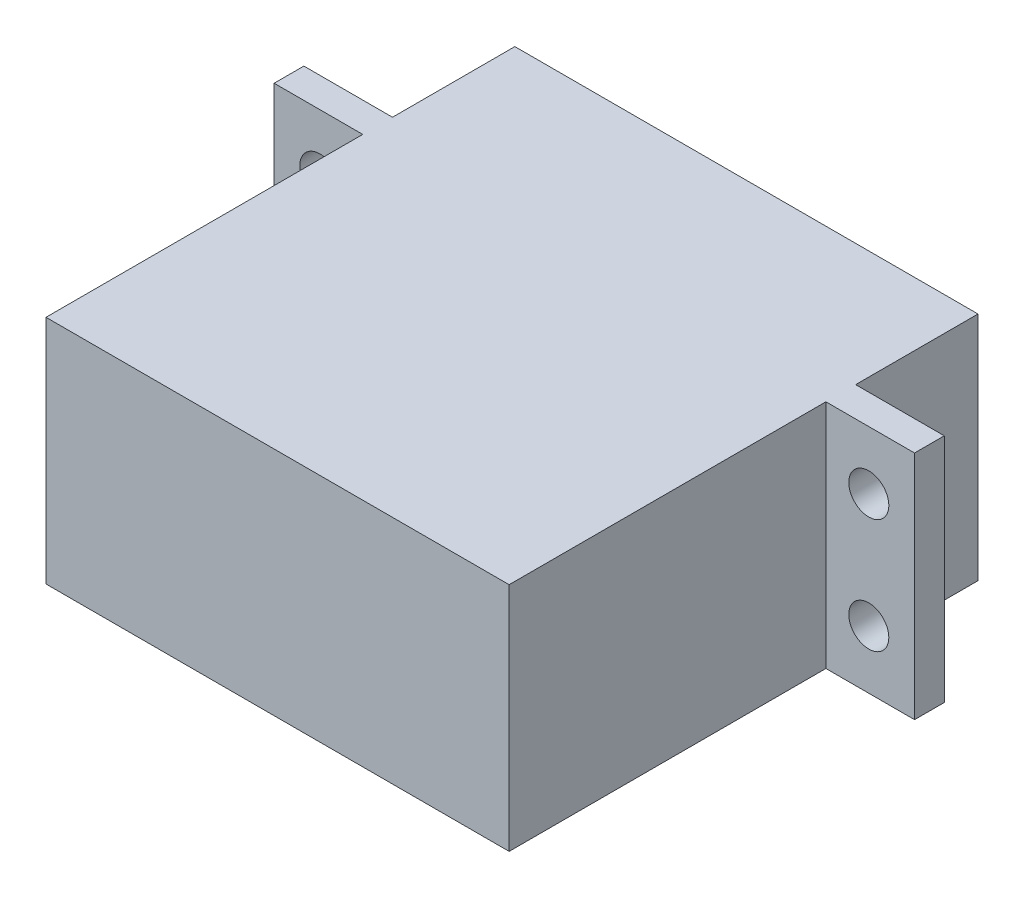
ISO-10303-21;
HEADER;
FILE_DESCRIPTION(('STEP AP214'),'2;1');
FILE_NAME('part.step','',(''),(''),'','','');
FILE_SCHEMA(('AUTOMOTIVE_DESIGN { 1 0 10303 214 1 1 1 1 }'));
ENDSEC;
DATA;
#1=APPLICATION_CONTEXT('core data for automotive mechanical design processes');
#2=APPLICATION_PROTOCOL_DEFINITION('international standard','automotive_design',2000,#1);
#3=PRODUCT_CONTEXT('',#1,'mechanical');
#4=PRODUCT('Part','Part','',(#3));
#5=PRODUCT_RELATED_PRODUCT_CATEGORY('part','',(#4));
#6=PRODUCT_DEFINITION_FORMATION('','',#4);
#7=PRODUCT_DEFINITION_CONTEXT('part definition',#1,'design');
#8=PRODUCT_DEFINITION('design','',#6,#7);
#9=PRODUCT_DEFINITION_SHAPE('','',#8);
#10=(LENGTH_UNIT() NAMED_UNIT(*) SI_UNIT(.MILLI.,.METRE.));
#11=(NAMED_UNIT(*) PLANE_ANGLE_UNIT() SI_UNIT($,.RADIAN.));
#12=(NAMED_UNIT(*) SI_UNIT($,.STERADIAN.) SOLID_ANGLE_UNIT());
#13=UNCERTAINTY_MEASURE_WITH_UNIT(LENGTH_MEASURE(1.E-05),#10,'distance_accuracy_value','');
#14=(GEOMETRIC_REPRESENTATION_CONTEXT(3) GLOBAL_UNCERTAINTY_ASSIGNED_CONTEXT((#13)) GLOBAL_UNIT_ASSIGNED_CONTEXT((#10,
#11,#12)) REPRESENTATION_CONTEXT('',''));
#15=CARTESIAN_POINT('',(0.,0.,0.));
#16=DIRECTION('',(0.,0.,1.));
#17=DIRECTION('',(1.,0.,0.));
#18=AXIS2_PLACEMENT_3D('',#15,#16,#17);
#19=CARTESIAN_POINT('',(20.25,-10.1,41.));
#20=DIRECTION('',(-1.,0.,0.));
#21=DIRECTION('',(0.,0.,1.));
#22=AXIS2_PLACEMENT_3D('',#19,#20,#21);
#23=PLANE('',#22);
#24=DIRECTION('',(0.,-1.,0.));
#25=VECTOR('',#24,1.);
#26=CARTESIAN_POINT('',(20.25,-10.1,13.3));
#27=LINE('',#26,#25);
#28=CARTESIAN_POINT('',(20.25,10.1,13.3));
#29=VERTEX_POINT('',#28);
#30=CARTESIAN_POINT('',(20.25,-10.1,13.3));
#31=VERTEX_POINT('',#30);
#32=EDGE_CURVE('E58',#29,#31,#27,.T.);
#33=ORIENTED_EDGE('',*,*,#32,.F.);
#34=DIRECTION('',(0.,0.,-1.));
#35=VECTOR('',#34,1.);
#36=CARTESIAN_POINT('',(20.25,10.1,41.));
#37=LINE('',#36,#35);
#38=CARTESIAN_POINT('',(20.25,10.1,41.));
#39=VERTEX_POINT('',#38);
#40=EDGE_CURVE('E11',#39,#29,#37,.T.);
#41=ORIENTED_EDGE('',*,*,#40,.F.);
#42=DIRECTION('',(0.,1.,0.));
#43=VECTOR('',#42,1.);
#44=CARTESIAN_POINT('',(20.25,-10.1,41.));
#45=LINE('',#44,#43);
#46=CARTESIAN_POINT('',(20.25,-10.1,41.));
#47=VERTEX_POINT('',#46);
#48=EDGE_CURVE('E217',#47,#39,#45,.T.);
#49=ORIENTED_EDGE('',*,*,#48,.F.);
#50=DIRECTION('',(0.,0.,-1.));
#51=VECTOR('',#50,1.);
#52=CARTESIAN_POINT('',(20.25,-10.1,41.));
#53=LINE('',#52,#51);
#54=EDGE_CURVE('E237',#47,#31,#53,.T.);
#55=ORIENTED_EDGE('',*,*,#54,.T.);
#56=EDGE_LOOP('',(#33,#41,#49,#55));
#57=FACE_BOUND('',#56,.T.);
#58=ADVANCED_FACE('F36',(#57),#23,.F.);
#59=CARTESIAN_POINT('',(-20.25,-10.1,41.));
#60=DIRECTION('',(1.,0.,0.));
#61=DIRECTION('',(0.,0.,-1.));
#62=AXIS2_PLACEMENT_3D('',#59,#60,#61);
#63=PLANE('',#62);
#64=DIRECTION('',(0.,1.,0.));
#65=VECTOR('',#64,1.);
#66=CARTESIAN_POINT('',(-20.25,-10.1,13.3));
#67=LINE('',#66,#65);
#68=CARTESIAN_POINT('',(-20.25,-10.1,13.3));
#69=VERTEX_POINT('',#68);
#70=CARTESIAN_POINT('',(-20.25,10.1,13.3));
#71=VERTEX_POINT('',#70);
#72=EDGE_CURVE('E202',#69,#71,#67,.T.);
#73=ORIENTED_EDGE('',*,*,#72,.F.);
#74=DIRECTION('',(0.,0.,-1.));
#75=VECTOR('',#74,1.);
#76=CARTESIAN_POINT('',(-20.25,-10.1,41.));
#77=LINE('',#76,#75);
#78=CARTESIAN_POINT('',(-20.25,-10.1,41.));
#79=VERTEX_POINT('',#78);
#80=EDGE_CURVE('E240',#79,#69,#77,.T.);
#81=ORIENTED_EDGE('',*,*,#80,.F.);
#82=DIRECTION('',(0.,-1.,0.));
#83=VECTOR('',#82,1.);
#84=CARTESIAN_POINT('',(-20.25,-10.1,41.));
#85=LINE('',#84,#83);
#86=CARTESIAN_POINT('',(-20.25,10.1,41.));
#87=VERTEX_POINT('',#86);
#88=EDGE_CURVE('E223',#87,#79,#85,.T.);
#89=ORIENTED_EDGE('',*,*,#88,.F.);
#90=DIRECTION('',(0.,0.,-1.));
#91=VECTOR('',#90,1.);
#92=CARTESIAN_POINT('',(-20.25,10.1,41.));
#93=LINE('',#92,#91);
#94=EDGE_CURVE('E243',#87,#71,#93,.T.);
#95=ORIENTED_EDGE('',*,*,#94,.T.);
#96=EDGE_LOOP('',(#73,#81,#89,#95));
#97=FACE_BOUND('',#96,.T.);
#98=ADVANCED_FACE('F279',(#97),#63,.F.);
#99=CARTESIAN_POINT('',(20.25,10.1,10.7));
#100=VERTEX_POINT('',#99);
#101=CARTESIAN_POINT('',(20.25,10.1,0.));
#102=VERTEX_POINT('',#101);
#103=EDGE_CURVE('E44',#100,#102,#37,.T.);
#104=ORIENTED_EDGE('',*,*,#103,.F.);
#105=DIRECTION('',(0.,-1.,0.));
#106=VECTOR('',#105,1.);
#107=CARTESIAN_POINT('',(20.25,-10.1,10.7));
#108=LINE('',#107,#106);
#109=CARTESIAN_POINT('',(20.25,-10.1,10.7));
#110=VERTEX_POINT('',#109);
#111=EDGE_CURVE('E214',#100,#110,#108,.T.);
#112=ORIENTED_EDGE('',*,*,#111,.T.);
#113=CARTESIAN_POINT('',(20.25,-10.1,0.));
#114=VERTEX_POINT('',#113);
#115=EDGE_CURVE('E227',#110,#114,#53,.T.);
#116=ORIENTED_EDGE('',*,*,#115,.T.);
#117=DIRECTION('',(0.,1.,0.));
#118=VECTOR('',#117,1.);
#119=CARTESIAN_POINT('',(20.25,-10.1,0.));
#120=LINE('',#119,#118);
#121=EDGE_CURVE('E216',#114,#102,#120,.T.);
#122=ORIENTED_EDGE('',*,*,#121,.T.);
#123=EDGE_LOOP('',(#104,#112,#116,#122));
#124=FACE_BOUND('',#123,.T.);
#125=ADVANCED_FACE('F38',(#124),#23,.F.);
#126=CARTESIAN_POINT('',(-20.25,10.1,41.));
#127=DIRECTION('',(0.,-1.,0.));
#128=DIRECTION('',(0.,0.,-1.));
#129=AXIS2_PLACEMENT_3D('',#126,#127,#128);
#130=PLANE('',#129);
#131=CARTESIAN_POINT('',(-20.25,10.1,10.7));
#132=VERTEX_POINT('',#131);
#133=CARTESIAN_POINT('',(-20.25,10.1,0.));
#134=VERTEX_POINT('',#133);
#135=EDGE_CURVE('E242',#132,#134,#93,.T.);
#136=ORIENTED_EDGE('',*,*,#135,.F.);
#137=DIRECTION('',(-1.,0.,0.));
#138=VECTOR('',#137,1.);
#139=CARTESIAN_POINT('',(-28.,10.1,10.7));
#140=LINE('',#139,#138);
#141=CARTESIAN_POINT('',(-28.,10.1,10.7));
#142=VERTEX_POINT('',#141);
#143=EDGE_CURVE('E174',#132,#142,#140,.T.);
#144=ORIENTED_EDGE('',*,*,#143,.T.);
#145=DIRECTION('',(0.,0.,1.));
#146=VECTOR('',#145,1.);
#147=CARTESIAN_POINT('',(-28.,10.1,10.7));
#148=LINE('',#147,#146);
#149=CARTESIAN_POINT('',(-28.,10.1,13.3));
#150=VERTEX_POINT('',#149);
#151=EDGE_CURVE('E205',#142,#150,#148,.T.);
#152=ORIENTED_EDGE('',*,*,#151,.T.);
#153=DIRECTION('',(-1.,0.,0.));
#154=VECTOR('',#153,1.);
#155=CARTESIAN_POINT('',(-28.,10.1,13.3));
#156=LINE('',#155,#154);
#157=EDGE_CURVE('E189',#71,#150,#156,.T.);
#158=ORIENTED_EDGE('',*,*,#157,.F.);
#159=ORIENTED_EDGE('',*,*,#94,.F.);
#160=DIRECTION('',(-1.,0.,0.));
#161=VECTOR('',#160,1.);
#162=CARTESIAN_POINT('',(-20.25,10.1,41.));
#163=LINE('',#162,#161);
#164=EDGE_CURVE('E220',#39,#87,#163,.T.);
#165=ORIENTED_EDGE('',*,*,#164,.F.);
#166=ORIENTED_EDGE('',*,*,#40,.T.);
#167=CARTESIAN_POINT('',(28.,10.1,13.3));
#168=VERTEX_POINT('',#167);
#169=EDGE_CURVE('E190',#168,#29,#156,.T.);
#170=ORIENTED_EDGE('',*,*,#169,.F.);
#171=DIRECTION('',(0.,0.,1.));
#172=VECTOR('',#171,1.);
#173=CARTESIAN_POINT('',(28.,10.1,10.7));
#174=LINE('',#173,#172);
#175=CARTESIAN_POINT('',(28.,10.1,10.7));
#176=VERTEX_POINT('',#175);
#177=EDGE_CURVE('E186',#176,#168,#174,.T.);
#178=ORIENTED_EDGE('',*,*,#177,.F.);
#179=EDGE_CURVE('E176',#176,#100,#140,.T.);
#180=ORIENTED_EDGE('',*,*,#179,.T.);
#181=ORIENTED_EDGE('',*,*,#103,.T.);
#182=DIRECTION('',(-1.,0.,0.));
#183=VECTOR('',#182,1.);
#184=CARTESIAN_POINT('',(-20.25,10.1,0.));
#185=LINE('',#184,#183);
#186=EDGE_CURVE('E229',#102,#134,#185,.T.);
#187=ORIENTED_EDGE('',*,*,#186,.T.);
#188=EDGE_LOOP('',(#136,#144,#152,#158,#159,#165,#166,#170,#178,#180,#181,#187));
#189=FACE_BOUND('',#188,.T.);
#190=ADVANCED_FACE('F256',(#189),#130,.F.);
#191=CARTESIAN_POINT('',(-20.25,-10.1,10.7));
#192=VERTEX_POINT('',#191);
#193=CARTESIAN_POINT('',(-20.25,-10.1,0.));
#194=VERTEX_POINT('',#193);
#195=EDGE_CURVE('E239',#192,#194,#77,.T.);
#196=ORIENTED_EDGE('',*,*,#195,.F.);
#197=DIRECTION('',(0.,1.,0.));
#198=VECTOR('',#197,1.);
#199=CARTESIAN_POINT('',(-20.25,-10.1,10.7));
#200=LINE('',#199,#198);
#201=EDGE_CURVE('E212',#192,#132,#200,.T.);
#202=ORIENTED_EDGE('',*,*,#201,.T.);
#203=ORIENTED_EDGE('',*,*,#135,.T.);
#204=DIRECTION('',(0.,-1.,0.));
#205=VECTOR('',#204,1.);
#206=CARTESIAN_POINT('',(-20.25,-10.1,0.));
#207=LINE('',#206,#205);
#208=EDGE_CURVE('E232',#134,#194,#207,.T.);
#209=ORIENTED_EDGE('',*,*,#208,.T.);
#210=EDGE_LOOP('',(#196,#202,#203,#209));
#211=FACE_BOUND('',#210,.T.);
#212=ADVANCED_FACE('F249',(#211),#63,.F.);
#213=CARTESIAN_POINT('',(-20.25,-10.1,41.));
#214=DIRECTION('',(0.,1.,0.));
#215=DIRECTION('',(0.,0.,1.));
#216=AXIS2_PLACEMENT_3D('',#213,#214,#215);
#217=PLANE('',#216);
#218=ORIENTED_EDGE('',*,*,#115,.F.);
#219=DIRECTION('',(1.,0.,0.));
#220=VECTOR('',#219,1.);
#221=CARTESIAN_POINT('',(-28.,-10.1,10.7));
#222=LINE('',#221,#220);
#223=CARTESIAN_POINT('',(28.,-10.1,10.7));
#224=VERTEX_POINT('',#223);
#225=EDGE_CURVE('E182',#110,#224,#222,.T.);
#226=ORIENTED_EDGE('',*,*,#225,.T.);
#227=DIRECTION('',(0.,0.,1.));
#228=VECTOR('',#227,1.);
#229=CARTESIAN_POINT('',(28.,-10.1,10.7));
#230=LINE('',#229,#228);
#231=CARTESIAN_POINT('',(28.,-10.1,13.3));
#232=VERTEX_POINT('',#231);
#233=EDGE_CURVE('E199',#224,#232,#230,.T.);
#234=ORIENTED_EDGE('',*,*,#233,.T.);
#235=DIRECTION('',(1.,0.,0.));
#236=VECTOR('',#235,1.);
#237=CARTESIAN_POINT('',(-28.,-10.1,13.3));
#238=LINE('',#237,#236);
#239=EDGE_CURVE('E196',#31,#232,#238,.T.);
#240=ORIENTED_EDGE('',*,*,#239,.F.);
#241=ORIENTED_EDGE('',*,*,#54,.F.);
#242=DIRECTION('',(1.,0.,0.));
#243=VECTOR('',#242,1.);
#244=CARTESIAN_POINT('',(-20.25,-10.1,41.));
#245=LINE('',#244,#243);
#246=EDGE_CURVE('E225',#79,#47,#245,.T.);
#247=ORIENTED_EDGE('',*,*,#246,.F.);
#248=ORIENTED_EDGE('',*,*,#80,.T.);
#249=CARTESIAN_POINT('',(-28.,-10.1,13.3));
#250=VERTEX_POINT('',#249);
#251=EDGE_CURVE('E175',#250,#69,#238,.T.);
#252=ORIENTED_EDGE('',*,*,#251,.F.);
#253=DIRECTION('',(0.,0.,1.));
#254=VECTOR('',#253,1.);
#255=CARTESIAN_POINT('',(-28.,-10.1,10.7));
#256=LINE('',#255,#254);
#257=CARTESIAN_POINT('',(-28.,-10.1,10.7));
#258=VERTEX_POINT('',#257);
#259=EDGE_CURVE('E203',#258,#250,#256,.T.);
#260=ORIENTED_EDGE('',*,*,#259,.F.);
#261=EDGE_CURVE('E183',#258,#192,#222,.T.);
#262=ORIENTED_EDGE('',*,*,#261,.T.);
#263=ORIENTED_EDGE('',*,*,#195,.T.);
#264=DIRECTION('',(1.,0.,0.));
#265=VECTOR('',#264,1.);
#266=CARTESIAN_POINT('',(-20.25,-10.1,0.));
#267=LINE('',#266,#265);
#268=EDGE_CURVE('E221',#194,#114,#267,.T.);
#269=ORIENTED_EDGE('',*,*,#268,.T.);
#270=EDGE_LOOP('',(#218,#226,#234,#240,#241,#247,#248,#252,#260,#262,#263,#269));
#271=FACE_BOUND('',#270,.T.);
#272=ADVANCED_FACE('F262',(#271),#217,.F.);
#273=CARTESIAN_POINT('',(0.,0.,41.));
#274=DIRECTION('',(0.,0.,-1.));
#275=DIRECTION('',(-1.,0.,0.));
#276=AXIS2_PLACEMENT_3D('',#273,#274,#275);
#277=PLANE('',#276);
#278=ORIENTED_EDGE('',*,*,#48,.T.);
#279=ORIENTED_EDGE('',*,*,#164,.T.);
#280=ORIENTED_EDGE('',*,*,#88,.T.);
#281=ORIENTED_EDGE('',*,*,#246,.T.);
#282=EDGE_LOOP('',(#278,#279,#280,#281));
#283=FACE_BOUND('',#282,.T.);
#284=ADVANCED_FACE('F283',(#283),#277,.F.);
#285=CARTESIAN_POINT('',(0.,0.,0.));
#286=DIRECTION('',(0.,0.,-1.));
#287=DIRECTION('',(-1.,0.,0.));
#288=AXIS2_PLACEMENT_3D('',#285,#286,#287);
#289=PLANE('',#288);
#290=CARTESIAN_POINT('',(-9.75,0.,0.));
#291=DIRECTION('',(0.,0.,-1.));
#292=DIRECTION('',(-1.,0.,0.));
#293=AXIS2_PLACEMENT_3D('',#290,#291,#292);
#294=CIRCLE('',#293,2.);
#295=CARTESIAN_POINT('',(-11.75,0.,0.));
#296=VERTEX_POINT('',#295);
#297=EDGE_CURVE('E135',#296,#296,#294,.T.);
#298=ORIENTED_EDGE('',*,*,#297,.F.);
#299=EDGE_LOOP('',(#298));
#300=FACE_BOUND('',#299,.T.);
#301=ORIENTED_EDGE('',*,*,#121,.F.);
#302=ORIENTED_EDGE('',*,*,#268,.F.);
#303=ORIENTED_EDGE('',*,*,#208,.F.);
#304=ORIENTED_EDGE('',*,*,#186,.F.);
#305=EDGE_LOOP('',(#301,#302,#303,#304));
#306=FACE_BOUND('',#305,.T.);
#307=ADVANCED_FACE('F259',(#300,#306),#289,.T.);
#308=CARTESIAN_POINT('',(-28.,-10.1,10.7));
#309=DIRECTION('',(-1.,0.,0.));
#310=DIRECTION('',(0.,-1.,0.));
#311=AXIS2_PLACEMENT_3D('',#308,#309,#310);
#312=PLANE('',#311);
#313=DIRECTION('',(0.,-1.,0.));
#314=VECTOR('',#313,1.);
#315=CARTESIAN_POINT('',(-28.,-10.1,13.3));
#316=LINE('',#315,#314);
#317=EDGE_CURVE('E193',#150,#250,#316,.T.);
#318=ORIENTED_EDGE('',*,*,#317,.F.);
#319=ORIENTED_EDGE('',*,*,#151,.F.);
#320=DIRECTION('',(0.,-1.,0.));
#321=VECTOR('',#320,1.);
#322=CARTESIAN_POINT('',(-28.,-10.1,10.7));
#323=LINE('',#322,#321);
#324=EDGE_CURVE('E179',#142,#258,#323,.T.);
#325=ORIENTED_EDGE('',*,*,#324,.T.);
#326=ORIENTED_EDGE('',*,*,#259,.T.);
#327=EDGE_LOOP('',(#318,#319,#325,#326));
#328=FACE_BOUND('',#327,.T.);
#329=ADVANCED_FACE('F272',(#328),#312,.T.);
#330=CARTESIAN_POINT('',(0.,0.,13.3));
#331=DIRECTION('',(0.,0.,-1.));
#332=DIRECTION('',(-1.,0.,0.));
#333=AXIS2_PLACEMENT_3D('',#330,#331,#332);
#334=PLANE('',#333);
#335=CARTESIAN_POINT('',(-24.,5.,13.3));
#336=DIRECTION('',(0.,0.,-1.));
#337=DIRECTION('',(1.,0.,0.));
#338=AXIS2_PLACEMENT_3D('',#335,#336,#337);
#339=CIRCLE('',#338,1.75);
#340=CARTESIAN_POINT('',(-22.25,5.,13.3));
#341=VERTEX_POINT('',#340);
#342=EDGE_CURVE('E147',#341,#341,#339,.T.);
#343=ORIENTED_EDGE('',*,*,#342,.T.);
#344=EDGE_LOOP('',(#343));
#345=FACE_BOUND('',#344,.T.);
#346=CARTESIAN_POINT('',(-24.,-5.,13.3));
#347=DIRECTION('',(0.,0.,-1.));
#348=DIRECTION('',(-1.,0.,0.));
#349=AXIS2_PLACEMENT_3D('',#346,#347,#348);
#350=CIRCLE('',#349,1.75);
#351=CARTESIAN_POINT('',(-25.75,-5.,13.3));
#352=VERTEX_POINT('',#351);
#353=EDGE_CURVE('E154',#352,#352,#350,.T.);
#354=ORIENTED_EDGE('',*,*,#353,.T.);
#355=EDGE_LOOP('',(#354));
#356=FACE_BOUND('',#355,.T.);
#357=ORIENTED_EDGE('',*,*,#251,.T.);
#358=ORIENTED_EDGE('',*,*,#72,.T.);
#359=ORIENTED_EDGE('',*,*,#157,.T.);
#360=ORIENTED_EDGE('',*,*,#317,.T.);
#361=EDGE_LOOP('',(#357,#358,#359,#360));
#362=FACE_BOUND('',#361,.T.);
#363=ADVANCED_FACE('F275',(#345,#356,#362),#334,.F.);
#364=CARTESIAN_POINT('',(0.,0.,10.7));
#365=DIRECTION('',(0.,0.,-1.));
#366=DIRECTION('',(-1.,0.,0.));
#367=AXIS2_PLACEMENT_3D('',#364,#365,#366);
#368=PLANE('',#367);
#369=CARTESIAN_POINT('',(-24.,5.,10.7));
#370=DIRECTION('',(0.,0.,-1.));
#371=DIRECTION('',(1.,0.,0.));
#372=AXIS2_PLACEMENT_3D('',#369,#370,#371);
#373=CIRCLE('',#372,1.75);
#374=CARTESIAN_POINT('',(-22.25,5.,10.7));
#375=VERTEX_POINT('',#374);
#376=EDGE_CURVE('E151',#375,#375,#373,.T.);
#377=ORIENTED_EDGE('',*,*,#376,.F.);
#378=EDGE_LOOP('',(#377));
#379=FACE_BOUND('',#378,.T.);
#380=CARTESIAN_POINT('',(-24.,-5.,10.7));
#381=DIRECTION('',(0.,0.,-1.));
#382=DIRECTION('',(-1.,0.,0.));
#383=AXIS2_PLACEMENT_3D('',#380,#381,#382);
#384=CIRCLE('',#383,1.75);
#385=CARTESIAN_POINT('',(-25.75,-5.,10.7));
#386=VERTEX_POINT('',#385);
#387=EDGE_CURVE('E157',#386,#386,#384,.T.);
#388=ORIENTED_EDGE('',*,*,#387,.F.);
#389=EDGE_LOOP('',(#388));
#390=FACE_BOUND('',#389,.T.);
#391=ORIENTED_EDGE('',*,*,#201,.F.);
#392=ORIENTED_EDGE('',*,*,#261,.F.);
#393=ORIENTED_EDGE('',*,*,#324,.F.);
#394=ORIENTED_EDGE('',*,*,#143,.F.);
#395=EDGE_LOOP('',(#391,#392,#393,#394));
#396=FACE_BOUND('',#395,.T.);
#397=ADVANCED_FACE('F266',(#379,#390,#396),#368,.T.);
#398=CARTESIAN_POINT('',(24.,-5.,10.7));
#399=DIRECTION('',(0.,0.,-1.));
#400=DIRECTION('',(1.,0.,0.));
#401=AXIS2_PLACEMENT_3D('',#398,#399,#400);
#402=CIRCLE('',#401,1.75);
#403=CARTESIAN_POINT('',(25.75,-5.,10.7));
#404=VERTEX_POINT('',#403);
#405=EDGE_CURVE('E145',#404,#404,#402,.T.);
#406=ORIENTED_EDGE('',*,*,#405,.F.);
#407=EDGE_LOOP('',(#406));
#408=FACE_BOUND('',#407,.T.);
#409=CARTESIAN_POINT('',(24.,5.,10.7));
#410=DIRECTION('',(0.,0.,-1.));
#411=DIRECTION('',(-1.,0.,0.));
#412=AXIS2_PLACEMENT_3D('',#409,#410,#411);
#413=CIRCLE('',#412,1.75);
#414=CARTESIAN_POINT('',(22.25,5.,10.7));
#415=VERTEX_POINT('',#414);
#416=EDGE_CURVE('E150',#415,#415,#413,.T.);
#417=ORIENTED_EDGE('',*,*,#416,.F.);
#418=EDGE_LOOP('',(#417));
#419=FACE_BOUND('',#418,.T.);
#420=ORIENTED_EDGE('',*,*,#111,.F.);
#421=ORIENTED_EDGE('',*,*,#179,.F.);
#422=DIRECTION('',(0.,1.,0.));
#423=VECTOR('',#422,1.);
#424=CARTESIAN_POINT('',(28.,-10.1,10.7));
#425=LINE('',#424,#423);
#426=EDGE_CURVE('E171',#224,#176,#425,.T.);
#427=ORIENTED_EDGE('',*,*,#426,.F.);
#428=ORIENTED_EDGE('',*,*,#225,.F.);
#429=EDGE_LOOP('',(#420,#421,#427,#428));
#430=FACE_BOUND('',#429,.T.);
#431=ADVANCED_FACE('F314',(#408,#419,#430),#368,.T.);
#432=CARTESIAN_POINT('',(24.,-5.,13.3));
#433=DIRECTION('',(0.,0.,-1.));
#434=DIRECTION('',(1.,0.,0.));
#435=AXIS2_PLACEMENT_3D('',#432,#433,#434);
#436=CIRCLE('',#435,1.75);
#437=CARTESIAN_POINT('',(25.75,-5.,13.3));
#438=VERTEX_POINT('',#437);
#439=EDGE_CURVE('E160',#438,#438,#436,.T.);
#440=ORIENTED_EDGE('',*,*,#439,.T.);
#441=EDGE_LOOP('',(#440));
#442=FACE_BOUND('',#441,.T.);
#443=CARTESIAN_POINT('',(24.,5.,13.3));
#444=DIRECTION('',(0.,0.,-1.));
#445=DIRECTION('',(-1.,0.,0.));
#446=AXIS2_PLACEMENT_3D('',#443,#444,#445);
#447=CIRCLE('',#446,1.75);
#448=CARTESIAN_POINT('',(22.25,5.,13.3));
#449=VERTEX_POINT('',#448);
#450=EDGE_CURVE('E165',#449,#449,#447,.T.);
#451=ORIENTED_EDGE('',*,*,#450,.T.);
#452=EDGE_LOOP('',(#451));
#453=FACE_BOUND('',#452,.T.);
#454=ORIENTED_EDGE('',*,*,#169,.T.);
#455=ORIENTED_EDGE('',*,*,#32,.T.);
#456=ORIENTED_EDGE('',*,*,#239,.T.);
#457=DIRECTION('',(0.,1.,0.));
#458=VECTOR('',#457,1.);
#459=CARTESIAN_POINT('',(28.,-10.1,13.3));
#460=LINE('',#459,#458);
#461=EDGE_CURVE('E168',#232,#168,#460,.T.);
#462=ORIENTED_EDGE('',*,*,#461,.T.);
#463=EDGE_LOOP('',(#454,#455,#456,#462));
#464=FACE_BOUND('',#463,.T.);
#465=ADVANCED_FACE('F308',(#442,#453,#464),#334,.F.);
#466=CARTESIAN_POINT('',(28.,-10.1,10.7));
#467=DIRECTION('',(1.,0.,0.));
#468=DIRECTION('',(0.,0.,-1.));
#469=AXIS2_PLACEMENT_3D('',#466,#467,#468);
#470=PLANE('',#469);
#471=ORIENTED_EDGE('',*,*,#461,.F.);
#472=ORIENTED_EDGE('',*,*,#233,.F.);
#473=ORIENTED_EDGE('',*,*,#426,.T.);
#474=ORIENTED_EDGE('',*,*,#177,.T.);
#475=EDGE_LOOP('',(#471,#472,#473,#474));
#476=FACE_BOUND('',#475,.T.);
#477=ADVANCED_FACE('F304',(#476),#470,.T.);
#478=CARTESIAN_POINT('',(24.,5.,13.3));
#479=DIRECTION('',(0.,0.,-1.));
#480=DIRECTION('',(-1.,0.,0.));
#481=AXIS2_PLACEMENT_3D('',#478,#479,#480);
#482=CYLINDRICAL_SURFACE('',#481,1.75);
#483=ORIENTED_EDGE('',*,*,#450,.F.);
#484=EDGE_LOOP('',(#483));
#485=FACE_BOUND('',#484,.T.);
#486=ORIENTED_EDGE('',*,*,#416,.T.);
#487=EDGE_LOOP('',(#486));
#488=FACE_BOUND('',#487,.T.);
#489=ADVANCED_FACE('F307',(#485,#488),#482,.F.);
#490=CARTESIAN_POINT('',(24.,-5.,13.3));
#491=DIRECTION('',(0.,0.,-1.));
#492=DIRECTION('',(-1.,0.,0.));
#493=AXIS2_PLACEMENT_3D('',#490,#491,#492);
#494=CYLINDRICAL_SURFACE('',#493,1.75);
#495=ORIENTED_EDGE('',*,*,#439,.F.);
#496=EDGE_LOOP('',(#495));
#497=FACE_BOUND('',#496,.T.);
#498=ORIENTED_EDGE('',*,*,#405,.T.);
#499=EDGE_LOOP('',(#498));
#500=FACE_BOUND('',#499,.T.);
#501=ADVANCED_FACE('F321',(#497,#500),#494,.F.);
#502=CARTESIAN_POINT('',(-24.,-5.,13.3));
#503=DIRECTION('',(0.,0.,-1.));
#504=DIRECTION('',(-1.,0.,0.));
#505=AXIS2_PLACEMENT_3D('',#502,#503,#504);
#506=CYLINDRICAL_SURFACE('',#505,1.75);
#507=ORIENTED_EDGE('',*,*,#353,.F.);
#508=EDGE_LOOP('',(#507));
#509=FACE_BOUND('',#508,.T.);
#510=ORIENTED_EDGE('',*,*,#387,.T.);
#511=EDGE_LOOP('',(#510));
#512=FACE_BOUND('',#511,.T.);
#513=ADVANCED_FACE('F325',(#509,#512),#506,.F.);
#514=CARTESIAN_POINT('',(-24.,5.,13.3));
#515=DIRECTION('',(0.,0.,-1.));
#516=DIRECTION('',(-1.,0.,0.));
#517=AXIS2_PLACEMENT_3D('',#514,#515,#516);
#518=CYLINDRICAL_SURFACE('',#517,1.75);
#519=ORIENTED_EDGE('',*,*,#342,.F.);
#520=EDGE_LOOP('',(#519));
#521=FACE_BOUND('',#520,.T.);
#522=ORIENTED_EDGE('',*,*,#376,.T.);
#523=EDGE_LOOP('',(#522));
#524=FACE_BOUND('',#523,.T.);
#525=ADVANCED_FACE('F329',(#521,#524),#518,.F.);
#526=CARTESIAN_POINT('',(-9.75,0.,-4.));
#527=DIRECTION('',(0.,0.,1.));
#528=DIRECTION('',(1.,0.,0.));
#529=AXIS2_PLACEMENT_3D('',#526,#527,#528);
#530=CYLINDRICAL_SURFACE('',#529,2.);
#531=CARTESIAN_POINT('',(-9.75,0.,-4.));
#532=DIRECTION('',(0.,0.,-1.));
#533=DIRECTION('',(-1.,0.,0.));
#534=AXIS2_PLACEMENT_3D('',#531,#532,#533);
#535=CIRCLE('',#534,2.);
#536=CARTESIAN_POINT('',(-11.75,0.,-4.));
#537=VERTEX_POINT('',#536);
#538=EDGE_CURVE('E139',#537,#537,#535,.T.);
#539=ORIENTED_EDGE('',*,*,#538,.F.);
#540=EDGE_LOOP('',(#539));
#541=FACE_BOUND('',#540,.T.);
#542=ORIENTED_EDGE('',*,*,#297,.T.);
#543=EDGE_LOOP('',(#542));
#544=FACE_BOUND('',#543,.T.);
#545=ADVANCED_FACE('F333',(#541,#544),#530,.T.);
#546=CARTESIAN_POINT('',(-9.75,0.,-4.));
#547=DIRECTION('',(0.,0.,-1.));
#548=DIRECTION('',(-1.,0.,0.));
#549=AXIS2_PLACEMENT_3D('',#546,#547,#548);
#550=PLANE('',#549);
#551=CARTESIAN_POINT('',(-9.75,0.,-4.));
#552=DIRECTION('',(0.,0.,-1.));
#553=DIRECTION('',(-1.,0.,0.));
#554=AXIS2_PLACEMENT_3D('',#551,#552,#553);
#555=CIRCLE('',#554,1.24999999999999);
#556=CARTESIAN_POINT('',(-11.,0.,-4.));
#557=VERTEX_POINT('',#556);
#558=EDGE_CURVE('E136',#557,#557,#555,.T.);
#559=ORIENTED_EDGE('',*,*,#558,.F.);
#560=EDGE_LOOP('',(#559));
#561=FACE_BOUND('',#560,.T.);
#562=ORIENTED_EDGE('',*,*,#538,.T.);
#563=EDGE_LOOP('',(#562));
#564=FACE_BOUND('',#563,.T.);
#565=ADVANCED_FACE('F129',(#561,#564),#550,.T.);
#566=CARTESIAN_POINT('',(-9.75,0.,0.));
#567=DIRECTION('',(0.,0.,-1.));
#568=DIRECTION('',(-1.,0.,0.));
#569=AXIS2_PLACEMENT_3D('',#566,#567,#568);
#570=CONICAL_SURFACE('',#569,1.25,1.02974425867665);
#571=CARTESIAN_POINT('',(-9.75,0.,0.751075773784451));
#572=VERTEX_POINT('',#571);
#573=VERTEX_LOOP('',#572);
#574=FACE_BOUND('',#573,.T.);
#575=CARTESIAN_POINT('',(-9.75,0.,0.));
#576=DIRECTION('',(0.,0.,-1.));
#577=DIRECTION('',(-1.,0.,0.));
#578=AXIS2_PLACEMENT_3D('',#575,#576,#577);
#579=CIRCLE('',#578,1.25);
#580=CARTESIAN_POINT('',(-11.,0.,0.));
#581=VERTEX_POINT('',#580);
#582=EDGE_CURVE('E133',#581,#581,#579,.T.);
#583=ORIENTED_EDGE('',*,*,#582,.T.);
#584=EDGE_LOOP('',(#583));
#585=FACE_BOUND('',#584,.T.);
#586=ADVANCED_FACE('F125',(#574,#585),#570,.F.);
#587=CARTESIAN_POINT('',(-9.75,0.,-4.));
#588=DIRECTION('',(0.,0.,-1.));
#589=DIRECTION('',(-1.,0.,0.));
#590=AXIS2_PLACEMENT_3D('',#587,#588,#589);
#591=CYLINDRICAL_SURFACE('',#590,1.24999999999999);
#592=ORIENTED_EDGE('',*,*,#582,.F.);
#593=EDGE_LOOP('',(#592));
#594=FACE_BOUND('',#593,.T.);
#595=ORIENTED_EDGE('',*,*,#558,.T.);
#596=EDGE_LOOP('',(#595));
#597=FACE_BOUND('',#596,.T.);
#598=ADVANCED_FACE('F128',(#594,#597),#591,.F.);
#599=CLOSED_SHELL('',(#58,#98,#125,#190,#212,#272,#284,#307,#329,#363,#397,#431,#465,#477,#489,
#501,#513,#525,#545,#565,#586,#598));
#600=MANIFOLD_SOLID_BREP('B2',#599);
#601=ADVANCED_BREP_SHAPE_REPRESENTATION('',(#18,#600),#14);
#602=SHAPE_DEFINITION_REPRESENTATION(#9,#601);
ENDSEC;
END-ISO-10303-21;
